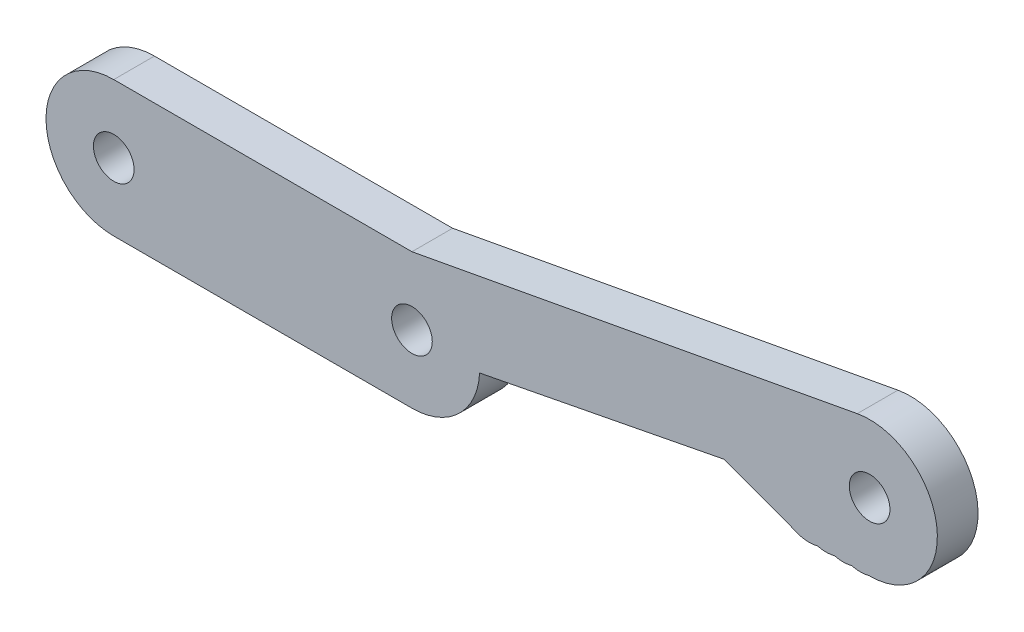
ISO-10303-21;
HEADER;
FILE_DESCRIPTION(('STEP AP214'),'2;1');
FILE_NAME('part.step','',(''),(''),'','','');
FILE_SCHEMA(('AUTOMOTIVE_DESIGN { 1 0 10303 214 1 1 1 1 }'));
ENDSEC;
DATA;
#1=APPLICATION_CONTEXT('core data for automotive mechanical design processes');
#2=APPLICATION_PROTOCOL_DEFINITION('international standard','automotive_design',2000,#1);
#3=PRODUCT_CONTEXT('',#1,'mechanical');
#4=PRODUCT('Part','Part','',(#3));
#5=PRODUCT_RELATED_PRODUCT_CATEGORY('part','',(#4));
#6=PRODUCT_DEFINITION_FORMATION('','',#4);
#7=PRODUCT_DEFINITION_CONTEXT('part definition',#1,'design');
#8=PRODUCT_DEFINITION('design','',#6,#7);
#9=PRODUCT_DEFINITION_SHAPE('','',#8);
#10=(LENGTH_UNIT() NAMED_UNIT(*) SI_UNIT(.MILLI.,.METRE.));
#11=(NAMED_UNIT(*) PLANE_ANGLE_UNIT() SI_UNIT($,.RADIAN.));
#12=(NAMED_UNIT(*) SI_UNIT($,.STERADIAN.) SOLID_ANGLE_UNIT());
#13=UNCERTAINTY_MEASURE_WITH_UNIT(LENGTH_MEASURE(1.E-05),#10,'distance_accuracy_value','');
#14=(GEOMETRIC_REPRESENTATION_CONTEXT(3) GLOBAL_UNCERTAINTY_ASSIGNED_CONTEXT((#13)) GLOBAL_UNIT_ASSIGNED_CONTEXT((#10,
#11,#12)) REPRESENTATION_CONTEXT('',''));
#15=CARTESIAN_POINT('',(0.,0.,0.));
#16=DIRECTION('',(0.,0.,1.));
#17=DIRECTION('',(1.,0.,0.));
#18=AXIS2_PLACEMENT_3D('',#15,#16,#17);
#19=CARTESIAN_POINT('',(0.,0.,3.));
#20=DIRECTION('',(0.,0.,-1.));
#21=DIRECTION('',(-1.,0.,0.));
#22=AXIS2_PLACEMENT_3D('',#19,#20,#21);
#23=CYLINDRICAL_SURFACE('',#22,5.);
#24=CARTESIAN_POINT('',(0.,0.,0.));
#25=DIRECTION('',(0.,0.,1.));
#26=DIRECTION('',(1.,0.,0.));
#27=AXIS2_PLACEMENT_3D('',#24,#25,#26);
#28=CIRCLE('',#27,5.);
#29=CARTESIAN_POINT('',(0.,5.,0.));
#30=VERTEX_POINT('',#29);
#31=CARTESIAN_POINT('',(0.,-5.,0.));
#32=VERTEX_POINT('',#31);
#33=EDGE_CURVE('E187',#30,#32,#28,.T.);
#34=ORIENTED_EDGE('',*,*,#33,.T.);
#35=DIRECTION('',(0.,0.,-1.));
#36=VECTOR('',#35,1.);
#37=CARTESIAN_POINT('',(0.,-5.,3.));
#38=LINE('',#37,#36);
#39=CARTESIAN_POINT('',(0.,-5.,3.));
#40=VERTEX_POINT('',#39);
#41=EDGE_CURVE('E11',#40,#32,#38,.T.);
#42=ORIENTED_EDGE('',*,*,#41,.F.);
#43=CARTESIAN_POINT('',(0.,0.,3.));
#44=DIRECTION('',(0.,0.,1.));
#45=DIRECTION('',(1.,0.,0.));
#46=AXIS2_PLACEMENT_3D('',#43,#44,#45);
#47=CIRCLE('',#46,5.);
#48=CARTESIAN_POINT('',(0.,5.,3.));
#49=VERTEX_POINT('',#48);
#50=EDGE_CURVE('E543',#49,#40,#47,.T.);
#51=ORIENTED_EDGE('',*,*,#50,.F.);
#52=DIRECTION('',(0.,0.,-1.));
#53=VECTOR('',#52,1.);
#54=CARTESIAN_POINT('',(0.,5.,3.));
#55=LINE('',#54,#53);
#56=EDGE_CURVE('E60',#49,#30,#55,.T.);
#57=ORIENTED_EDGE('',*,*,#56,.T.);
#58=EDGE_LOOP('',(#34,#42,#51,#57));
#59=FACE_BOUND('',#58,.T.);
#60=ADVANCED_FACE('F42',(#59),#23,.T.);
#61=CARTESIAN_POINT('',(0.,-5.,3.));
#62=DIRECTION('',(0.,1.,0.));
#63=DIRECTION('',(-1.,0.,0.));
#64=AXIS2_PLACEMENT_3D('',#61,#62,#63);
#65=PLANE('',#64);
#66=DIRECTION('',(1.,0.,0.));
#67=VECTOR('',#66,1.);
#68=CARTESIAN_POINT('',(0.,-5.,0.));
#69=LINE('',#68,#67);
#70=CARTESIAN_POINT('',(22.,-5.00000000000001,0.));
#71=VERTEX_POINT('',#70);
#72=EDGE_CURVE('E190',#32,#71,#69,.T.);
#73=ORIENTED_EDGE('',*,*,#72,.T.);
#74=DIRECTION('',(0.,0.,-1.));
#75=VECTOR('',#74,1.);
#76=CARTESIAN_POINT('',(22.,-5.00000000000001,3.));
#77=LINE('',#76,#75);
#78=CARTESIAN_POINT('',(22.,-5.00000000000001,3.));
#79=VERTEX_POINT('',#78);
#80=EDGE_CURVE('E52',#79,#71,#77,.T.);
#81=ORIENTED_EDGE('',*,*,#80,.F.);
#82=DIRECTION('',(1.,0.,0.));
#83=VECTOR('',#82,1.);
#84=CARTESIAN_POINT('',(0.,-5.,3.));
#85=LINE('',#84,#83);
#86=EDGE_CURVE('E113',#40,#79,#85,.T.);
#87=ORIENTED_EDGE('',*,*,#86,.F.);
#88=ORIENTED_EDGE('',*,*,#41,.T.);
#89=EDGE_LOOP('',(#73,#81,#87,#88));
#90=FACE_BOUND('',#89,.T.);
#91=ADVANCED_FACE('F331',(#90),#65,.F.);
#92=CARTESIAN_POINT('',(22.,0.,3.));
#93=DIRECTION('',(0.,0.,-1.));
#94=DIRECTION('',(-1.,0.,0.));
#95=AXIS2_PLACEMENT_3D('',#92,#93,#94);
#96=CYLINDRICAL_SURFACE('',#95,5.00000000000002);
#97=CARTESIAN_POINT('',(22.,0.,0.));
#98=DIRECTION('',(0.,0.,1.));
#99=DIRECTION('',(1.,0.,0.));
#100=AXIS2_PLACEMENT_3D('',#97,#98,#99);
#101=CIRCLE('',#100,5.00000000000002);
#102=CARTESIAN_POINT('',(26.9937250447277,-0.250420002513943,0.));
#103=VERTEX_POINT('',#102);
#104=EDGE_CURVE('E193',#71,#103,#101,.T.);
#105=ORIENTED_EDGE('',*,*,#104,.T.);
#106=DIRECTION('',(0.,0.,-1.));
#107=VECTOR('',#106,1.);
#108=CARTESIAN_POINT('',(26.9937250447277,-0.250420002513943,3.));
#109=LINE('',#108,#107);
#110=CARTESIAN_POINT('',(26.9937250447277,-0.250420002513943,3.));
#111=VERTEX_POINT('',#110);
#112=EDGE_CURVE('E267',#111,#103,#109,.T.);
#113=ORIENTED_EDGE('',*,*,#112,.F.);
#114=CARTESIAN_POINT('',(22.,0.,3.));
#115=DIRECTION('',(0.,0.,1.));
#116=DIRECTION('',(1.,0.,0.));
#117=AXIS2_PLACEMENT_3D('',#114,#115,#116);
#118=CIRCLE('',#117,5.00000000000002);
#119=EDGE_CURVE('E276',#79,#111,#118,.T.);
#120=ORIENTED_EDGE('',*,*,#119,.F.);
#121=ORIENTED_EDGE('',*,*,#80,.T.);
#122=EDGE_LOOP('',(#105,#113,#120,#121));
#123=FACE_BOUND('',#122,.T.);
#124=ADVANCED_FACE('F274',(#123),#96,.T.);
#125=CARTESIAN_POINT('',(1.0279697658608,-5.29315823230867,3.));
#126=DIRECTION('',(0.190645303888248,-0.981658987686334,0.));
#127=DIRECTION('',(0.981658987686334,0.190645303888248,0.));
#128=AXIS2_PLACEMENT_3D('',#125,#126,#127);
#129=PLANE('',#128);
#130=DIRECTION('',(-0.981658987686334,-0.190645303888248,0.));
#131=VECTOR('',#130,1.);
#132=CARTESIAN_POINT('',(1.0279697658608,-5.29315823230867,0.));
#133=LINE('',#132,#131);
#134=CARTESIAN_POINT('',(45.0418326183647,3.25465354761306,0.));
#135=VERTEX_POINT('',#134);
#136=EDGE_CURVE('E197',#135,#103,#133,.T.);
#137=ORIENTED_EDGE('',*,*,#136,.F.);
#138=DIRECTION('',(0.,0.,-1.));
#139=VECTOR('',#138,1.);
#140=CARTESIAN_POINT('',(45.0418326183647,3.25465354761306,3.));
#141=LINE('',#140,#139);
#142=CARTESIAN_POINT('',(45.0418326183647,3.25465354761306,3.));
#143=VERTEX_POINT('',#142);
#144=EDGE_CURVE('E264',#143,#135,#141,.T.);
#145=ORIENTED_EDGE('',*,*,#144,.F.);
#146=DIRECTION('',(-0.981658987686334,-0.190645303888248,0.));
#147=VECTOR('',#146,1.);
#148=CARTESIAN_POINT('',(1.0279697658608,-5.29315823230867,3.));
#149=LINE('',#148,#147);
#150=EDGE_CURVE('E287',#143,#111,#149,.T.);
#151=ORIENTED_EDGE('',*,*,#150,.T.);
#152=ORIENTED_EDGE('',*,*,#112,.T.);
#153=EDGE_LOOP('',(#137,#145,#151,#152));
#154=FACE_BOUND('',#153,.T.);
#155=ADVANCED_FACE('F284',(#154),#129,.T.);
#156=CARTESIAN_POINT('',(6.52148847178108,17.560254085187,3.));
#157=DIRECTION('',(-0.348144701486604,-0.937440807105602,0.));
#158=DIRECTION('',(0.937440807105603,-0.348144701486604,0.));
#159=AXIS2_PLACEMENT_3D('',#156,#157,#158);
#160=PLANE('',#159);
#161=DIRECTION('',(-0.937440807105603,0.348144701486604,0.));
#162=VECTOR('',#161,1.);
#163=CARTESIAN_POINT('',(6.52148847178108,17.560254085187,0.));
#164=LINE('',#163,#162);
#165=CARTESIAN_POINT('',(50.6664774609983,1.16578533869343,0.));
#166=VERTEX_POINT('',#165);
#167=EDGE_CURVE('E201',#166,#135,#164,.T.);
#168=ORIENTED_EDGE('',*,*,#167,.F.);
#169=DIRECTION('',(0.,0.,-1.));
#170=VECTOR('',#169,1.);
#171=CARTESIAN_POINT('',(50.6664774609983,1.16578533869343,3.));
#172=LINE('',#171,#170);
#173=CARTESIAN_POINT('',(50.6664774609983,1.16578533869343,3.));
#174=VERTEX_POINT('',#173);
#175=EDGE_CURVE('E261',#174,#166,#172,.T.);
#176=ORIENTED_EDGE('',*,*,#175,.F.);
#177=DIRECTION('',(-0.937440807105603,0.348144701486604,0.));
#178=VECTOR('',#177,1.);
#179=CARTESIAN_POINT('',(6.52148847178108,17.560254085187,3.));
#180=LINE('',#179,#178);
#181=EDGE_CURVE('E291',#174,#143,#180,.T.);
#182=ORIENTED_EDGE('',*,*,#181,.T.);
#183=ORIENTED_EDGE('',*,*,#144,.T.);
#184=EDGE_LOOP('',(#168,#176,#182,#183));
#185=FACE_BOUND('',#184,.T.);
#186=ADVANCED_FACE('F341',(#185),#160,.T.);
#187=CARTESIAN_POINT('',(51.2939774609983,3.46578397999738,3.));
#188=DIRECTION('',(0.,0.,-1.));
#189=DIRECTION('',(-1.,0.,0.));
#190=AXIS2_PLACEMENT_3D('',#187,#188,#189);
#191=CYLINDRICAL_SURFACE('',#190,2.38406166027643);
#192=CARTESIAN_POINT('',(51.2939774609983,3.46578397999738,0.));
#193=DIRECTION('',(0.,0.,1.));
#194=DIRECTION('',(1.,0.,0.));
#195=AXIS2_PLACEMENT_3D('',#192,#193,#194);
#196=CIRCLE('',#195,2.38406166027643);
#197=CARTESIAN_POINT('',(51.9214774609983,1.16578533869343,0.));
#198=VERTEX_POINT('',#197);
#199=EDGE_CURVE('E205',#166,#198,#196,.T.);
#200=ORIENTED_EDGE('',*,*,#199,.T.);
#201=DIRECTION('',(0.,0.,-1.));
#202=VECTOR('',#201,1.);
#203=CARTESIAN_POINT('',(51.9214774609983,1.16578533869343,3.));
#204=LINE('',#203,#202);
#205=CARTESIAN_POINT('',(51.9214774609983,1.16578533869343,3.));
#206=VERTEX_POINT('',#205);
#207=EDGE_CURVE('E257',#206,#198,#204,.T.);
#208=ORIENTED_EDGE('',*,*,#207,.F.);
#209=CARTESIAN_POINT('',(51.2939774609983,3.46578397999738,3.));
#210=DIRECTION('',(0.,0.,1.));
#211=DIRECTION('',(1.,0.,0.));
#212=AXIS2_PLACEMENT_3D('',#209,#210,#211);
#213=CIRCLE('',#212,2.38406166027643);
#214=EDGE_CURVE('E295',#174,#206,#213,.T.);
#215=ORIENTED_EDGE('',*,*,#214,.F.);
#216=ORIENTED_EDGE('',*,*,#175,.T.);
#217=EDGE_LOOP('',(#200,#208,#215,#216));
#218=FACE_BOUND('',#217,.T.);
#219=ADVANCED_FACE('F344',(#218),#191,.T.);
#220=CARTESIAN_POINT('',(52.5514774609983,3.46423103788749,3.));
#221=DIRECTION('',(0.,0.,-1.));
#222=DIRECTION('',(-1.,0.,0.));
#223=AXIS2_PLACEMENT_3D('',#220,#221,#222);
#224=CYLINDRICAL_SURFACE('',#223,2.38322316037413);
#225=CARTESIAN_POINT('',(52.5514774609983,3.46423103788749,0.));
#226=DIRECTION('',(0.,0.,1.));
#227=DIRECTION('',(1.,0.,0.));
#228=AXIS2_PLACEMENT_3D('',#225,#226,#227);
#229=CIRCLE('',#228,2.38322316037413);
#230=CARTESIAN_POINT('',(53.1814774609983,1.16578533869343,0.));
#231=VERTEX_POINT('',#230);
#232=EDGE_CURVE('E208',#198,#231,#229,.T.);
#233=ORIENTED_EDGE('',*,*,#232,.T.);
#234=DIRECTION('',(0.,0.,-1.));
#235=VECTOR('',#234,1.);
#236=CARTESIAN_POINT('',(53.1814774609983,1.16578533869343,3.));
#237=LINE('',#236,#235);
#238=CARTESIAN_POINT('',(53.1814774609983,1.16578533869343,3.));
#239=VERTEX_POINT('',#238);
#240=EDGE_CURVE('E254',#239,#231,#237,.T.);
#241=ORIENTED_EDGE('',*,*,#240,.F.);
#242=CARTESIAN_POINT('',(52.5514774609983,3.46423103788749,3.));
#243=DIRECTION('',(0.,0.,1.));
#244=DIRECTION('',(1.,0.,0.));
#245=AXIS2_PLACEMENT_3D('',#242,#243,#244);
#246=CIRCLE('',#245,2.38322316037413);
#247=EDGE_CURVE('E302',#206,#239,#246,.T.);
#248=ORIENTED_EDGE('',*,*,#247,.F.);
#249=ORIENTED_EDGE('',*,*,#207,.T.);
#250=EDGE_LOOP('',(#233,#241,#248,#249));
#251=FACE_BOUND('',#250,.T.);
#252=ADVANCED_FACE('F348',(#251),#224,.T.);
#253=CARTESIAN_POINT('',(53.8114774609983,3.46578533869343,3.));
#254=DIRECTION('',(0.,0.,-1.));
#255=DIRECTION('',(-1.,0.,0.));
#256=AXIS2_PLACEMENT_3D('',#253,#254,#255);
#257=CYLINDRICAL_SURFACE('',#256,2.38472220604413);
#258=CARTESIAN_POINT('',(53.8114774609983,3.46578533869343,0.));
#259=DIRECTION('',(0.,0.,1.));
#260=DIRECTION('',(1.,0.,0.));
#261=AXIS2_PLACEMENT_3D('',#258,#259,#260);
#262=CIRCLE('',#261,2.38472220604413);
#263=CARTESIAN_POINT('',(54.4414774609983,1.16578533869343,0.));
#264=VERTEX_POINT('',#263);
#265=EDGE_CURVE('E212',#264,#231,#262,.F.);
#266=ORIENTED_EDGE('',*,*,#265,.F.);
#267=DIRECTION('',(0.,0.,-1.));
#268=VECTOR('',#267,1.);
#269=CARTESIAN_POINT('',(54.4414774609983,1.16578533869343,3.));
#270=LINE('',#269,#268);
#271=CARTESIAN_POINT('',(54.4414774609983,1.16578533869343,3.));
#272=VERTEX_POINT('',#271);
#273=EDGE_CURVE('E251',#272,#264,#270,.T.);
#274=ORIENTED_EDGE('',*,*,#273,.F.);
#275=CARTESIAN_POINT('',(53.8114774609983,3.46578533869343,3.));
#276=DIRECTION('',(0.,0.,1.));
#277=DIRECTION('',(1.,0.,0.));
#278=AXIS2_PLACEMENT_3D('',#275,#276,#277);
#279=CIRCLE('',#278,2.38472220604413);
#280=EDGE_CURVE('E305',#272,#239,#279,.F.);
#281=ORIENTED_EDGE('',*,*,#280,.T.);
#282=ORIENTED_EDGE('',*,*,#240,.T.);
#283=EDGE_LOOP('',(#266,#274,#281,#282));
#284=FACE_BOUND('',#283,.T.);
#285=ADVANCED_FACE('F352',(#284),#257,.T.);
#286=CARTESIAN_POINT('',(55.0714774609933,3.4657853386948,3.));
#287=DIRECTION('',(0.,0.,-1.));
#288=DIRECTION('',(-1.,0.,0.));
#289=AXIS2_PLACEMENT_3D('',#286,#287,#288);
#290=CYLINDRICAL_SURFACE('',#289,2.38472220604414);
#291=CARTESIAN_POINT('',(55.0714774609933,3.4657853386948,0.));
#292=DIRECTION('',(0.,0.,1.));
#293=DIRECTION('',(1.,0.,0.));
#294=AXIS2_PLACEMENT_3D('',#291,#292,#293);
#295=CIRCLE('',#294,2.38472220604414);
#296=CARTESIAN_POINT('',(55.7014774609983,1.16578533869614,0.));
#297=VERTEX_POINT('',#296);
#298=EDGE_CURVE('E216',#264,#297,#295,.T.);
#299=ORIENTED_EDGE('',*,*,#298,.T.);
#300=DIRECTION('',(0.,0.,-1.));
#301=VECTOR('',#300,1.);
#302=CARTESIAN_POINT('',(55.7014774609983,1.16578533869614,3.));
#303=LINE('',#302,#301);
#304=CARTESIAN_POINT('',(55.7014774609983,1.16578533869614,3.));
#305=VERTEX_POINT('',#304);
#306=EDGE_CURVE('E248',#305,#297,#303,.T.);
#307=ORIENTED_EDGE('',*,*,#306,.F.);
#308=CARTESIAN_POINT('',(55.0714774609933,3.4657853386948,3.));
#309=DIRECTION('',(0.,0.,1.));
#310=DIRECTION('',(1.,0.,0.));
#311=AXIS2_PLACEMENT_3D('',#308,#309,#310);
#312=CIRCLE('',#311,2.38472220604414);
#313=EDGE_CURVE('E309',#272,#305,#312,.T.);
#314=ORIENTED_EDGE('',*,*,#313,.F.);
#315=ORIENTED_EDGE('',*,*,#273,.T.);
#316=EDGE_LOOP('',(#299,#307,#314,#315));
#317=FACE_BOUND('',#316,.T.);
#318=ADVANCED_FACE('F356',(#317),#290,.T.);
#319=CARTESIAN_POINT('',(1.02943621602318E-11,1.165785339188,3.));
#320=DIRECTION('',(-8.83040969395105E-12,-1.,0.));
#321=DIRECTION('',(1.,-8.83040969395105E-12,0.));
#322=AXIS2_PLACEMENT_3D('',#319,#320,#321);
#323=PLANE('',#322);
#324=DIRECTION('',(-1.,8.83040969395105E-12,0.));
#325=VECTOR('',#324,1.);
#326=CARTESIAN_POINT('',(1.02943621602318E-11,1.165785339188,0.));
#327=LINE('',#326,#325);
#328=CARTESIAN_POINT('',(55.7664774609991,1.16578533869587,0.));
#329=VERTEX_POINT('',#328);
#330=EDGE_CURVE('E220',#329,#297,#327,.T.);
#331=ORIENTED_EDGE('',*,*,#330,.F.);
#332=DIRECTION('',(0.,0.,-1.));
#333=VECTOR('',#332,1.);
#334=CARTESIAN_POINT('',(55.7664774609991,1.16578533869587,3.));
#335=LINE('',#334,#333);
#336=CARTESIAN_POINT('',(55.7664774609991,1.16578533869587,3.));
#337=VERTEX_POINT('',#336);
#338=EDGE_CURVE('E165',#337,#329,#335,.T.);
#339=ORIENTED_EDGE('',*,*,#338,.F.);
#340=DIRECTION('',(-1.,8.83040969395105E-12,0.));
#341=VECTOR('',#340,1.);
#342=CARTESIAN_POINT('',(1.02943621602318E-11,1.165785339188,3.));
#343=LINE('',#342,#341);
#344=EDGE_CURVE('E153',#337,#305,#343,.T.);
#345=ORIENTED_EDGE('',*,*,#344,.T.);
#346=ORIENTED_EDGE('',*,*,#306,.T.);
#347=EDGE_LOOP('',(#331,#339,#345,#346));
#348=FACE_BOUND('',#347,.T.);
#349=ADVANCED_FACE('F314',(#348),#323,.T.);
#350=CARTESIAN_POINT('',(55.7664774609991,6.16578533869556,3.));
#351=DIRECTION('',(0.,0.,-1.));
#352=DIRECTION('',(-1.,0.,0.));
#353=AXIS2_PLACEMENT_3D('',#350,#351,#352);
#354=CYLINDRICAL_SURFACE('',#353,4.9999999999994);
#355=CARTESIAN_POINT('',(55.7664774609991,6.16578533869556,0.));
#356=DIRECTION('',(0.,0.,1.));
#357=DIRECTION('',(1.,0.,0.));
#358=AXIS2_PLACEMENT_3D('',#355,#356,#357);
#359=CIRCLE('',#358,4.9999999999994);
#360=CARTESIAN_POINT('',(54.8563573818384,11.0822557638589,0.));
#361=VERTEX_POINT('',#360);
#362=EDGE_CURVE('E161',#329,#361,#359,.T.);
#363=ORIENTED_EDGE('',*,*,#362,.T.);
#364=DIRECTION('',(0.,0.,-1.));
#365=VECTOR('',#364,1.);
#366=CARTESIAN_POINT('',(54.8563573818384,11.0822557638589,3.));
#367=LINE('',#366,#365);
#368=CARTESIAN_POINT('',(54.8563573818384,11.0822557638589,3.));
#369=VERTEX_POINT('',#368);
#370=EDGE_CURVE('E158',#369,#361,#367,.T.);
#371=ORIENTED_EDGE('',*,*,#370,.F.);
#372=CARTESIAN_POINT('',(55.7664774609991,6.16578533869556,3.));
#373=DIRECTION('',(0.,0.,1.));
#374=DIRECTION('',(1.,0.,0.));
#375=AXIS2_PLACEMENT_3D('',#372,#373,#374);
#376=CIRCLE('',#375,4.9999999999994);
#377=EDGE_CURVE('E145',#337,#369,#376,.T.);
#378=ORIENTED_EDGE('',*,*,#377,.F.);
#379=ORIENTED_EDGE('',*,*,#338,.T.);
#380=EDGE_LOOP('',(#363,#371,#378,#379));
#381=FACE_BOUND('',#380,.T.);
#382=ADVANCED_FACE('F159',(#381),#354,.T.);
#383=CARTESIAN_POINT('',(-0.16599535903566,0.896707250065009,3.));
#384=DIRECTION('',(-0.182024015832161,0.98329408503272,0.));
#385=DIRECTION('',(-0.98329408503272,-0.182024015832161,0.));
#386=AXIS2_PLACEMENT_3D('',#383,#384,#385);
#387=PLANE('',#386);
#388=DIRECTION('',(0.98329408503272,0.182024015832161,0.));
#389=VECTOR('',#388,1.);
#390=CARTESIAN_POINT('',(-0.16599535903566,0.896707250065009,0.));
#391=LINE('',#390,#389);
#392=CARTESIAN_POINT('',(22.,5.,0.));
#393=VERTEX_POINT('',#392);
#394=EDGE_CURVE('E226',#393,#361,#391,.T.);
#395=ORIENTED_EDGE('',*,*,#394,.F.);
#396=DIRECTION('',(0.,0.,-1.));
#397=VECTOR('',#396,1.);
#398=CARTESIAN_POINT('',(22.,5.,3.));
#399=LINE('',#398,#397);
#400=CARTESIAN_POINT('',(22.,5.,3.));
#401=VERTEX_POINT('',#400);
#402=EDGE_CURVE('E101',#401,#393,#399,.T.);
#403=ORIENTED_EDGE('',*,*,#402,.F.);
#404=DIRECTION('',(0.98329408503272,0.182024015832161,0.));
#405=VECTOR('',#404,1.);
#406=CARTESIAN_POINT('',(-0.16599535903566,0.896707250065009,3.));
#407=LINE('',#406,#405);
#408=EDGE_CURVE('E151',#401,#369,#407,.T.);
#409=ORIENTED_EDGE('',*,*,#408,.T.);
#410=ORIENTED_EDGE('',*,*,#370,.T.);
#411=EDGE_LOOP('',(#395,#403,#409,#410));
#412=FACE_BOUND('',#411,.T.);
#413=ADVANCED_FACE('F167',(#412),#387,.T.);
#414=CARTESIAN_POINT('',(22.,0.,3.));
#415=DIRECTION('',(0.,0.,-1.));
#416=DIRECTION('',(-1.,0.,0.));
#417=AXIS2_PLACEMENT_3D('',#414,#415,#416);
#418=CYLINDRICAL_SURFACE('',#417,1.49999999999999);
#419=CARTESIAN_POINT('',(22.,0.,3.));
#420=DIRECTION('',(0.,0.,1.));
#421=DIRECTION('',(1.,0.,0.));
#422=AXIS2_PLACEMENT_3D('',#419,#420,#421);
#423=CIRCLE('',#422,1.49999999999999);
#424=CARTESIAN_POINT('',(23.5,0.,3.));
#425=VERTEX_POINT('',#424);
#426=EDGE_CURVE('E172',#425,#425,#423,.T.);
#427=ORIENTED_EDGE('',*,*,#426,.T.);
#428=EDGE_LOOP('',(#427));
#429=FACE_BOUND('',#428,.T.);
#430=CARTESIAN_POINT('',(22.,0.,0.));
#431=DIRECTION('',(0.,0.,1.));
#432=DIRECTION('',(1.,0.,0.));
#433=AXIS2_PLACEMENT_3D('',#430,#431,#432);
#434=CIRCLE('',#433,1.49999999999999);
#435=CARTESIAN_POINT('',(23.5,0.,0.));
#436=VERTEX_POINT('',#435);
#437=EDGE_CURVE('E233',#436,#436,#434,.T.);
#438=ORIENTED_EDGE('',*,*,#437,.F.);
#439=EDGE_LOOP('',(#438));
#440=FACE_BOUND('',#439,.T.);
#441=ADVANCED_FACE('F319',(#429,#440),#418,.F.);
#442=CARTESIAN_POINT('',(0.,5.,3.));
#443=DIRECTION('',(0.,1.,0.));
#444=DIRECTION('',(0.,0.,1.));
#445=AXIS2_PLACEMENT_3D('',#442,#443,#444);
#446=PLANE('',#445);
#447=DIRECTION('',(1.,0.,0.));
#448=VECTOR('',#447,1.);
#449=CARTESIAN_POINT('',(0.,5.,0.));
#450=LINE('',#449,#448);
#451=EDGE_CURVE('E229',#30,#393,#450,.T.);
#452=ORIENTED_EDGE('',*,*,#451,.F.);
#453=ORIENTED_EDGE('',*,*,#56,.F.);
#454=DIRECTION('',(1.,0.,0.));
#455=VECTOR('',#454,1.);
#456=CARTESIAN_POINT('',(0.,5.,3.));
#457=LINE('',#456,#455);
#458=EDGE_CURVE('E169',#49,#401,#457,.T.);
#459=ORIENTED_EDGE('',*,*,#458,.T.);
#460=ORIENTED_EDGE('',*,*,#402,.T.);
#461=EDGE_LOOP('',(#452,#453,#459,#460));
#462=FACE_BOUND('',#461,.T.);
#463=ADVANCED_FACE('F317',(#462),#446,.T.);
#464=CARTESIAN_POINT('',(0.,0.,3.));
#465=DIRECTION('',(0.,0.,-1.));
#466=DIRECTION('',(-1.,0.,0.));
#467=AXIS2_PLACEMENT_3D('',#464,#465,#466);
#468=CYLINDRICAL_SURFACE('',#467,1.5);
#469=CARTESIAN_POINT('',(0.,0.,3.));
#470=DIRECTION('',(0.,0.,1.));
#471=DIRECTION('',(1.,0.,0.));
#472=AXIS2_PLACEMENT_3D('',#469,#470,#471);
#473=CIRCLE('',#472,1.5);
#474=CARTESIAN_POINT('',(1.5,0.,3.));
#475=VERTEX_POINT('',#474);
#476=EDGE_CURVE('E241',#475,#475,#473,.T.);
#477=ORIENTED_EDGE('',*,*,#476,.T.);
#478=EDGE_LOOP('',(#477));
#479=FACE_BOUND('',#478,.T.);
#480=CARTESIAN_POINT('',(0.,0.,0.));
#481=DIRECTION('',(0.,0.,1.));
#482=DIRECTION('',(1.,0.,0.));
#483=AXIS2_PLACEMENT_3D('',#480,#481,#482);
#484=CIRCLE('',#483,1.5);
#485=CARTESIAN_POINT('',(1.5,0.,0.));
#486=VERTEX_POINT('',#485);
#487=EDGE_CURVE('E183',#486,#486,#484,.T.);
#488=ORIENTED_EDGE('',*,*,#487,.F.);
#489=EDGE_LOOP('',(#488));
#490=FACE_BOUND('',#489,.T.);
#491=ADVANCED_FACE('F44',(#479,#490),#468,.F.);
#492=CARTESIAN_POINT('',(55.7664774609991,6.16578533869556,3.));
#493=DIRECTION('',(0.,0.,-1.));
#494=DIRECTION('',(-1.,0.,0.));
#495=AXIS2_PLACEMENT_3D('',#492,#493,#494);
#496=CYLINDRICAL_SURFACE('',#495,1.4999999999994);
#497=CARTESIAN_POINT('',(55.7664774609991,6.16578533869556,3.));
#498=DIRECTION('',(0.,0.,1.));
#499=DIRECTION('',(1.,0.,0.));
#500=AXIS2_PLACEMENT_3D('',#497,#498,#499);
#501=CIRCLE('',#500,1.4999999999994);
#502=CARTESIAN_POINT('',(57.2664774609985,6.16578533869556,3.));
#503=VERTEX_POINT('',#502);
#504=EDGE_CURVE('E179',#503,#503,#501,.T.);
#505=ORIENTED_EDGE('',*,*,#504,.T.);
#506=EDGE_LOOP('',(#505));
#507=FACE_BOUND('',#506,.T.);
#508=CARTESIAN_POINT('',(55.7664774609991,6.16578533869556,0.));
#509=DIRECTION('',(0.,0.,1.));
#510=DIRECTION('',(1.,0.,0.));
#511=AXIS2_PLACEMENT_3D('',#508,#509,#510);
#512=CIRCLE('',#511,1.4999999999994);
#513=CARTESIAN_POINT('',(57.2664774609985,6.16578533869556,0.));
#514=VERTEX_POINT('',#513);
#515=EDGE_CURVE('E237',#514,#514,#512,.T.);
#516=ORIENTED_EDGE('',*,*,#515,.F.);
#517=EDGE_LOOP('',(#516));
#518=FACE_BOUND('',#517,.T.);
#519=ADVANCED_FACE('F325',(#507,#518),#496,.F.);
#520=CARTESIAN_POINT('',(0.,0.,3.));
#521=DIRECTION('',(0.,0.,1.));
#522=DIRECTION('',(1.,0.,0.));
#523=AXIS2_PLACEMENT_3D('',#520,#521,#522);
#524=PLANE('',#523);
#525=ORIENTED_EDGE('',*,*,#476,.F.);
#526=EDGE_LOOP('',(#525));
#527=FACE_BOUND('',#526,.T.);
#528=ORIENTED_EDGE('',*,*,#50,.T.);
#529=ORIENTED_EDGE('',*,*,#86,.T.);
#530=ORIENTED_EDGE('',*,*,#119,.T.);
#531=ORIENTED_EDGE('',*,*,#150,.F.);
#532=ORIENTED_EDGE('',*,*,#181,.F.);
#533=ORIENTED_EDGE('',*,*,#214,.T.);
#534=ORIENTED_EDGE('',*,*,#247,.T.);
#535=ORIENTED_EDGE('',*,*,#280,.F.);
#536=ORIENTED_EDGE('',*,*,#313,.T.);
#537=ORIENTED_EDGE('',*,*,#344,.F.);
#538=ORIENTED_EDGE('',*,*,#377,.T.);
#539=ORIENTED_EDGE('',*,*,#408,.F.);
#540=ORIENTED_EDGE('',*,*,#458,.F.);
#541=EDGE_LOOP('',(#528,#529,#530,#531,#532,#533,#534,#535,#536,#537,#538,#539,#540));
#542=FACE_BOUND('',#541,.T.);
#543=ORIENTED_EDGE('',*,*,#426,.F.);
#544=EDGE_LOOP('',(#543));
#545=FACE_BOUND('',#544,.T.);
#546=ORIENTED_EDGE('',*,*,#504,.F.);
#547=EDGE_LOOP('',(#546));
#548=FACE_BOUND('',#547,.T.);
#549=ADVANCED_FACE('F147',(#527,#542,#545,#548),#524,.T.);
#550=CARTESIAN_POINT('',(0.,0.,0.));
#551=DIRECTION('',(0.,0.,1.));
#552=DIRECTION('',(1.,0.,0.));
#553=AXIS2_PLACEMENT_3D('',#550,#551,#552);
#554=PLANE('',#553);
#555=ORIENTED_EDGE('',*,*,#487,.T.);
#556=EDGE_LOOP('',(#555));
#557=FACE_BOUND('',#556,.T.);
#558=ORIENTED_EDGE('',*,*,#33,.F.);
#559=ORIENTED_EDGE('',*,*,#451,.T.);
#560=ORIENTED_EDGE('',*,*,#394,.T.);
#561=ORIENTED_EDGE('',*,*,#362,.F.);
#562=ORIENTED_EDGE('',*,*,#330,.T.);
#563=ORIENTED_EDGE('',*,*,#298,.F.);
#564=ORIENTED_EDGE('',*,*,#265,.T.);
#565=ORIENTED_EDGE('',*,*,#232,.F.);
#566=ORIENTED_EDGE('',*,*,#199,.F.);
#567=ORIENTED_EDGE('',*,*,#167,.T.);
#568=ORIENTED_EDGE('',*,*,#136,.T.);
#569=ORIENTED_EDGE('',*,*,#104,.F.);
#570=ORIENTED_EDGE('',*,*,#72,.F.);
#571=EDGE_LOOP('',(#558,#559,#560,#561,#562,#563,#564,#565,#566,#567,#568,#569,#570));
#572=FACE_BOUND('',#571,.T.);
#573=ORIENTED_EDGE('',*,*,#437,.T.);
#574=EDGE_LOOP('',(#573));
#575=FACE_BOUND('',#574,.T.);
#576=ORIENTED_EDGE('',*,*,#515,.T.);
#577=EDGE_LOOP('',(#576));
#578=FACE_BOUND('',#577,.T.);
#579=ADVANCED_FACE('F278',(#557,#572,#575,#578),#554,.F.);
#580=CLOSED_SHELL('',(#60,#91,#124,#155,#186,#219,#252,#285,#318,#349,#382,#413,#441,#463,#491,
#519,#549,#579));
#581=MANIFOLD_SOLID_BREP('B2',#580);
#582=ADVANCED_BREP_SHAPE_REPRESENTATION('',(#18,#581),#14);
#583=SHAPE_DEFINITION_REPRESENTATION(#9,#582);
ENDSEC;
END-ISO-10303-21;
